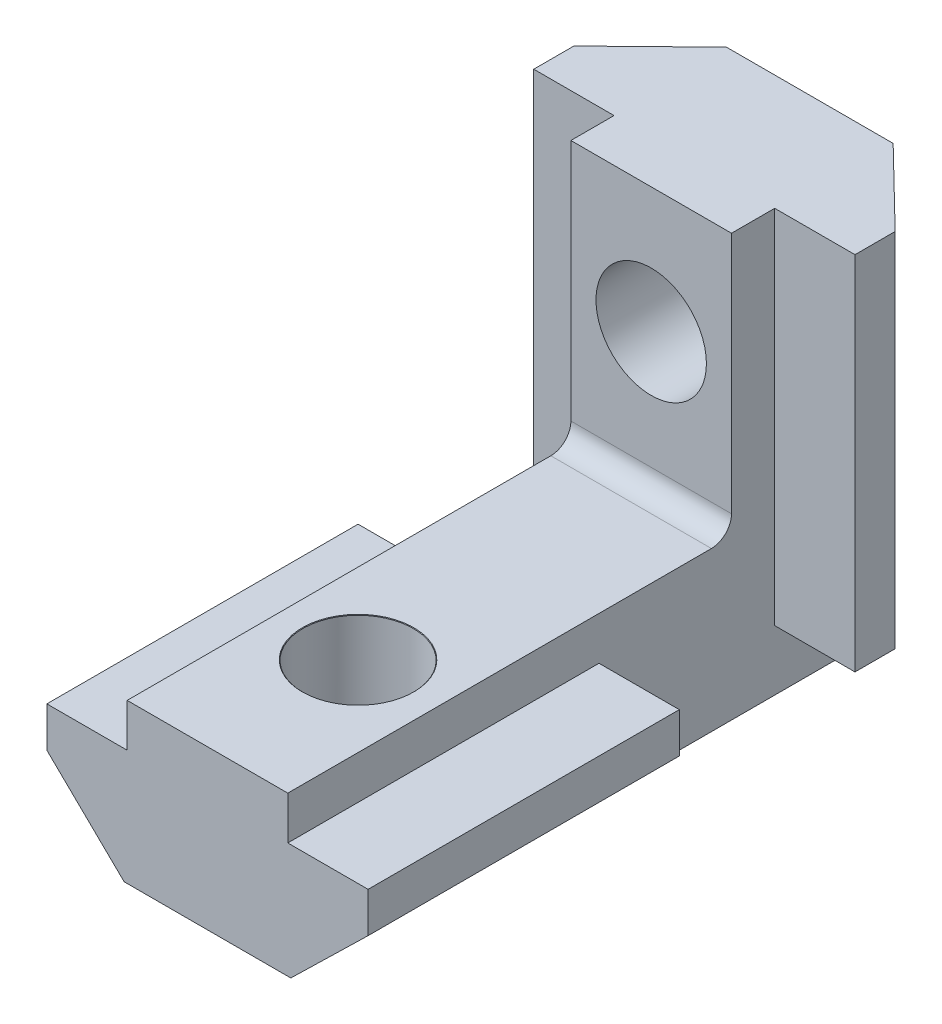
ISO-10303-21;
HEADER;
FILE_DESCRIPTION(('STEP AP214'),'2;1');
FILE_NAME('part.step','',(''),(''),'','','');
FILE_SCHEMA(('AUTOMOTIVE_DESIGN { 1 0 10303 214 1 1 1 1 }'));
ENDSEC;
DATA;
#1=APPLICATION_CONTEXT('core data for automotive mechanical design processes');
#2=APPLICATION_PROTOCOL_DEFINITION('international standard','automotive_design',2000,#1);
#3=PRODUCT_CONTEXT('',#1,'mechanical');
#4=PRODUCT('Part','Part','',(#3));
#5=PRODUCT_RELATED_PRODUCT_CATEGORY('part','',(#4));
#6=PRODUCT_DEFINITION_FORMATION('','',#4);
#7=PRODUCT_DEFINITION_CONTEXT('part definition',#1,'design');
#8=PRODUCT_DEFINITION('design','',#6,#7);
#9=PRODUCT_DEFINITION_SHAPE('','',#8);
#10=(LENGTH_UNIT() NAMED_UNIT(*) SI_UNIT(.MILLI.,.METRE.));
#11=(NAMED_UNIT(*) PLANE_ANGLE_UNIT() SI_UNIT($,.RADIAN.));
#12=(NAMED_UNIT(*) SI_UNIT($,.STERADIAN.) SOLID_ANGLE_UNIT());
#13=UNCERTAINTY_MEASURE_WITH_UNIT(LENGTH_MEASURE(1.E-05),#10,'distance_accuracy_value','');
#14=(GEOMETRIC_REPRESENTATION_CONTEXT(3) GLOBAL_UNCERTAINTY_ASSIGNED_CONTEXT((#13)) GLOBAL_UNIT_ASSIGNED_CONTEXT((#10,
#11,#12)) REPRESENTATION_CONTEXT('',''));
#15=CARTESIAN_POINT('',(0.,0.,0.));
#16=DIRECTION('',(0.,0.,1.));
#17=DIRECTION('',(1.,0.,0.));
#18=AXIS2_PLACEMENT_3D('',#15,#16,#17);
#19=CARTESIAN_POINT('',(-4.,7.9,-15.5));
#20=DIRECTION('',(-1.,0.,0.));
#21=DIRECTION('',(0.,0.,1.));
#22=AXIS2_PLACEMENT_3D('',#19,#20,#21);
#23=PLANE('',#22);
#24=DIRECTION('',(0.,0.,1.));
#25=VECTOR('',#24,1.);
#26=CARTESIAN_POINT('',(-4.,7.9,-15.5));
#27=LINE('',#26,#25);
#28=CARTESIAN_POINT('',(-4.,7.9,-21.1));
#29=VERTEX_POINT('',#28);
#30=CARTESIAN_POINT('',(-4.,7.9,0.));
#31=VERTEX_POINT('',#30);
#32=EDGE_CURVE('E316',#29,#31,#27,.T.);
#33=ORIENTED_EDGE('',*,*,#32,.F.);
#34=CARTESIAN_POINT('',(-4.,8.9,-21.1));
#35=DIRECTION('',(-1.,0.,0.));
#36=DIRECTION('',(0.,0.,1.));
#37=AXIS2_PLACEMENT_3D('',#34,#35,#36);
#38=CIRCLE('',#37,1.);
#39=CARTESIAN_POINT('',(-4.,8.9,-22.1));
#40=VERTEX_POINT('',#39);
#41=EDGE_CURVE('E54',#29,#40,#38,.F.);
#42=ORIENTED_EDGE('',*,*,#41,.T.);
#43=DIRECTION('',(0.,1.,0.));
#44=VECTOR('',#43,1.);
#45=CARTESIAN_POINT('',(-4.,-32.8440466262561,-22.1));
#46=LINE('',#45,#44);
#47=CARTESIAN_POINT('',(-4.,21.,-22.1));
#48=VERTEX_POINT('',#47);
#49=EDGE_CURVE('E258',#40,#48,#46,.T.);
#50=ORIENTED_EDGE('',*,*,#49,.T.);
#51=DIRECTION('',(0.,0.,-1.));
#52=VECTOR('',#51,1.);
#53=CARTESIAN_POINT('',(-4.,21.,-24.25));
#54=LINE('',#53,#52);
#55=CARTESIAN_POINT('',(-4.,21.,-24.25));
#56=VERTEX_POINT('',#55);
#57=EDGE_CURVE('E260',#48,#56,#54,.T.);
#58=ORIENTED_EDGE('',*,*,#57,.T.);
#59=DIRECTION('',(0.,1.,0.));
#60=VECTOR('',#59,1.);
#61=CARTESIAN_POINT('',(-4.,-32.8440466262561,-24.25));
#62=LINE('',#61,#60);
#63=CARTESIAN_POINT('',(-4.,3.,-24.25));
#64=VERTEX_POINT('',#63);
#65=EDGE_CURVE('E261',#64,#56,#62,.T.);
#66=ORIENTED_EDGE('',*,*,#65,.F.);
#67=DIRECTION('',(0.,0.,1.));
#68=VECTOR('',#67,1.);
#69=CARTESIAN_POINT('',(-4.,3.,-15.5));
#70=LINE('',#69,#68);
#71=CARTESIAN_POINT('',(-4.,3.,-30.));
#72=VERTEX_POINT('',#71);
#73=EDGE_CURVE('E229',#72,#64,#70,.T.);
#74=ORIENTED_EDGE('',*,*,#73,.F.);
#75=DIRECTION('',(0.,1.,0.));
#76=VECTOR('',#75,1.);
#77=CARTESIAN_POINT('',(-4.,0.,-30.));
#78=LINE('',#77,#76);
#79=CARTESIAN_POINT('',(-4.,0.,-30.));
#80=VERTEX_POINT('',#79);
#81=EDGE_CURVE('E216',#80,#72,#78,.T.);
#82=ORIENTED_EDGE('',*,*,#81,.F.);
#83=DIRECTION('',(0.,0.,1.));
#84=VECTOR('',#83,1.);
#85=CARTESIAN_POINT('',(-4.,0.,-30.));
#86=LINE('',#85,#84);
#87=CARTESIAN_POINT('',(-4.,0.,-15.5));
#88=VERTEX_POINT('',#87);
#89=EDGE_CURVE('E279',#80,#88,#86,.T.);
#90=ORIENTED_EDGE('',*,*,#89,.T.);
#91=DIRECTION('',(0.,1.,0.));
#92=VECTOR('',#91,1.);
#93=CARTESIAN_POINT('',(-4.,0.,-15.5));
#94=LINE('',#93,#92);
#95=CARTESIAN_POINT('',(-4.,5.75,-15.5));
#96=VERTEX_POINT('',#95);
#97=EDGE_CURVE('E273',#88,#96,#94,.T.);
#98=ORIENTED_EDGE('',*,*,#97,.T.);
#99=DIRECTION('',(0.,0.,1.));
#100=VECTOR('',#99,1.);
#101=CARTESIAN_POINT('',(-4.,5.75,-15.5));
#102=LINE('',#101,#100);
#103=CARTESIAN_POINT('',(-4.,5.75,0.));
#104=VERTEX_POINT('',#103);
#105=EDGE_CURVE('E313',#96,#104,#102,.T.);
#106=ORIENTED_EDGE('',*,*,#105,.T.);
#107=DIRECTION('',(0.,-1.,0.));
#108=VECTOR('',#107,1.);
#109=CARTESIAN_POINT('',(-4.,7.9,0.));
#110=LINE('',#109,#108);
#111=EDGE_CURVE('E339',#31,#104,#110,.T.);
#112=ORIENTED_EDGE('',*,*,#111,.F.);
#113=EDGE_LOOP('',(#33,#42,#50,#58,#66,#74,#82,#90,#98,#106,#112));
#114=FACE_BOUND('',#113,.T.);
#115=ADVANCED_FACE('F46',(#114),#23,.T.);
#116=CARTESIAN_POINT('',(4.,7.9,-15.5));
#117=DIRECTION('',(0.,1.,0.));
#118=DIRECTION('',(0.,0.,1.));
#119=AXIS2_PLACEMENT_3D('',#116,#117,#118);
#120=PLANE('',#119);
#121=CARTESIAN_POINT('',(0.,7.9,-7.5));
#122=DIRECTION('',(0.,1.,0.));
#123=DIRECTION('',(0.,0.,1.));
#124=AXIS2_PLACEMENT_3D('',#121,#122,#123);
#125=CIRCLE('',#124,2.775);
#126=CARTESIAN_POINT('',(0.,7.9,-4.725));
#127=VERTEX_POINT('',#126);
#128=EDGE_CURVE('E502',#127,#127,#125,.T.);
#129=ORIENTED_EDGE('',*,*,#128,.F.);
#130=EDGE_LOOP('',(#129));
#131=FACE_BOUND('',#130,.T.);
#132=DIRECTION('',(0.,0.,1.));
#133=VECTOR('',#132,1.);
#134=CARTESIAN_POINT('',(4.,7.9,-15.5));
#135=LINE('',#134,#133);
#136=CARTESIAN_POINT('',(4.,7.9,-21.1));
#137=VERTEX_POINT('',#136);
#138=CARTESIAN_POINT('',(4.,7.9,0.));
#139=VERTEX_POINT('',#138);
#140=EDGE_CURVE('E302',#137,#139,#135,.T.);
#141=ORIENTED_EDGE('',*,*,#140,.F.);
#142=DIRECTION('',(-1.,0.,0.));
#143=VECTOR('',#142,1.);
#144=CARTESIAN_POINT('',(4.,7.9,-21.1));
#145=LINE('',#144,#143);
#146=EDGE_CURVE('E289',#137,#29,#145,.T.);
#147=ORIENTED_EDGE('',*,*,#146,.T.);
#148=ORIENTED_EDGE('',*,*,#32,.T.);
#149=DIRECTION('',(-1.,0.,0.));
#150=VECTOR('',#149,1.);
#151=CARTESIAN_POINT('',(4.,7.9,0.));
#152=LINE('',#151,#150);
#153=EDGE_CURVE('E383',#139,#31,#152,.T.);
#154=ORIENTED_EDGE('',*,*,#153,.F.);
#155=EDGE_LOOP('',(#141,#147,#148,#154));
#156=FACE_BOUND('',#155,.T.);
#157=ADVANCED_FACE('F333',(#131,#156),#120,.T.);
#158=CARTESIAN_POINT('',(4.,5.75,-15.5));
#159=DIRECTION('',(1.,0.,0.));
#160=DIRECTION('',(0.,0.,-1.));
#161=AXIS2_PLACEMENT_3D('',#158,#159,#160);
#162=PLANE('',#161);
#163=DIRECTION('',(0.,1.,0.));
#164=VECTOR('',#163,1.);
#165=CARTESIAN_POINT('',(4.,-32.8440466262561,-24.25));
#166=LINE('',#165,#164);
#167=CARTESIAN_POINT('',(4.,3.,-24.25));
#168=VERTEX_POINT('',#167);
#169=CARTESIAN_POINT('',(4.,21.,-24.25));
#170=VERTEX_POINT('',#169);
#171=EDGE_CURVE('E252',#168,#170,#166,.T.);
#172=ORIENTED_EDGE('',*,*,#171,.T.);
#173=DIRECTION('',(0.,0.,1.));
#174=VECTOR('',#173,1.);
#175=CARTESIAN_POINT('',(4.,21.,-22.1));
#176=LINE('',#175,#174);
#177=CARTESIAN_POINT('',(4.,21.,-22.1));
#178=VERTEX_POINT('',#177);
#179=EDGE_CURVE('E254',#170,#178,#176,.T.);
#180=ORIENTED_EDGE('',*,*,#179,.T.);
#181=DIRECTION('',(0.,1.,0.));
#182=VECTOR('',#181,1.);
#183=CARTESIAN_POINT('',(4.,-32.8440466262561,-22.1));
#184=LINE('',#183,#182);
#185=CARTESIAN_POINT('',(4.,8.9,-22.1));
#186=VERTEX_POINT('',#185);
#187=EDGE_CURVE('E255',#186,#178,#184,.T.);
#188=ORIENTED_EDGE('',*,*,#187,.F.);
#189=CARTESIAN_POINT('',(4.,8.9,-21.1));
#190=DIRECTION('',(1.,0.,0.));
#191=DIRECTION('',(0.,0.,-1.));
#192=AXIS2_PLACEMENT_3D('',#189,#190,#191);
#193=CIRCLE('',#192,1.);
#194=EDGE_CURVE('E14',#186,#137,#193,.F.);
#195=ORIENTED_EDGE('',*,*,#194,.T.);
#196=ORIENTED_EDGE('',*,*,#140,.T.);
#197=DIRECTION('',(0.,1.,0.));
#198=VECTOR('',#197,1.);
#199=CARTESIAN_POINT('',(4.,5.75,0.));
#200=LINE('',#199,#198);
#201=CARTESIAN_POINT('',(4.,5.75,0.));
#202=VERTEX_POINT('',#201);
#203=EDGE_CURVE('E380',#202,#139,#200,.T.);
#204=ORIENTED_EDGE('',*,*,#203,.F.);
#205=DIRECTION('',(0.,0.,1.));
#206=VECTOR('',#205,1.);
#207=CARTESIAN_POINT('',(4.,5.75,-15.5));
#208=LINE('',#207,#206);
#209=CARTESIAN_POINT('',(4.,5.75,-15.5));
#210=VERTEX_POINT('',#209);
#211=EDGE_CURVE('E300',#210,#202,#208,.T.);
#212=ORIENTED_EDGE('',*,*,#211,.F.);
#213=DIRECTION('',(0.,-1.,0.));
#214=VECTOR('',#213,1.);
#215=CARTESIAN_POINT('',(4.,7.9,-15.5));
#216=LINE('',#215,#214);
#217=CARTESIAN_POINT('',(4.,0.,-15.5));
#218=VERTEX_POINT('',#217);
#219=EDGE_CURVE('E285',#210,#218,#216,.T.);
#220=ORIENTED_EDGE('',*,*,#219,.T.);
#221=DIRECTION('',(0.,0.,1.));
#222=VECTOR('',#221,1.);
#223=CARTESIAN_POINT('',(4.,0.,-30.));
#224=LINE('',#223,#222);
#225=CARTESIAN_POINT('',(4.,0.,-30.));
#226=VERTEX_POINT('',#225);
#227=EDGE_CURVE('E294',#226,#218,#224,.T.);
#228=ORIENTED_EDGE('',*,*,#227,.F.);
#229=DIRECTION('',(0.,-1.,0.));
#230=VECTOR('',#229,1.);
#231=CARTESIAN_POINT('',(4.,7.9,-30.));
#232=LINE('',#231,#230);
#233=CARTESIAN_POINT('',(4.,3.,-30.));
#234=VERTEX_POINT('',#233);
#235=EDGE_CURVE('E274',#234,#226,#232,.T.);
#236=ORIENTED_EDGE('',*,*,#235,.F.);
#237=DIRECTION('',(0.,0.,-1.));
#238=VECTOR('',#237,1.);
#239=CARTESIAN_POINT('',(4.,3.,-15.5));
#240=LINE('',#239,#238);
#241=EDGE_CURVE('E226',#168,#234,#240,.T.);
#242=ORIENTED_EDGE('',*,*,#241,.F.);
#243=EDGE_LOOP('',(#172,#180,#188,#195,#196,#204,#212,#220,#228,#236,#242));
#244=FACE_BOUND('',#243,.T.);
#245=ADVANCED_FACE('F419',(#244),#162,.T.);
#246=CARTESIAN_POINT('',(0.,0.,-15.5));
#247=DIRECTION('',(0.,0.,-1.));
#248=DIRECTION('',(-1.,0.,0.));
#249=AXIS2_PLACEMENT_3D('',#246,#247,#248);
#250=PLANE('',#249);
#251=ORIENTED_EDGE('',*,*,#97,.F.);
#252=DIRECTION('',(1.,0.,0.));
#253=VECTOR('',#252,1.);
#254=CARTESIAN_POINT('',(-4.15,0.,-15.5));
#255=LINE('',#254,#253);
#256=CARTESIAN_POINT('',(-4.15,0.,-15.5));
#257=VERTEX_POINT('',#256);
#258=EDGE_CURVE('E352',#257,#88,#255,.T.);
#259=ORIENTED_EDGE('',*,*,#258,.F.);
#260=DIRECTION('',(0.7163488096607,-0.697742347072111,0.));
#261=VECTOR('',#260,1.);
#262=CARTESIAN_POINT('',(-4.15,0.,-15.5));
#263=LINE('',#262,#261);
#264=CARTESIAN_POINT('',(-8.,3.75,-15.5));
#265=VERTEX_POINT('',#264);
#266=EDGE_CURVE('E358',#265,#257,#263,.T.);
#267=ORIENTED_EDGE('',*,*,#266,.F.);
#268=DIRECTION('',(0.,-1.,0.));
#269=VECTOR('',#268,1.);
#270=CARTESIAN_POINT('',(-8.,3.75,-15.5));
#271=LINE('',#270,#269);
#272=CARTESIAN_POINT('',(-8.,5.75,-15.5));
#273=VERTEX_POINT('',#272);
#274=EDGE_CURVE('E321',#273,#265,#271,.T.);
#275=ORIENTED_EDGE('',*,*,#274,.F.);
#276=DIRECTION('',(-1.,0.,0.));
#277=VECTOR('',#276,1.);
#278=CARTESIAN_POINT('',(-4.,5.75,-15.5));
#279=LINE('',#278,#277);
#280=EDGE_CURVE('E309',#96,#273,#279,.T.);
#281=ORIENTED_EDGE('',*,*,#280,.F.);
#282=EDGE_LOOP('',(#251,#259,#267,#275,#281));
#283=FACE_BOUND('',#282,.T.);
#284=ADVANCED_FACE('F411',(#283),#250,.T.);
#285=CARTESIAN_POINT('',(-4.15,0.,-15.5));
#286=DIRECTION('',(-0.697742347072111,-0.7163488096607,0.));
#287=DIRECTION('',(0.7163488096607,-0.697742347072111,0.));
#288=AXIS2_PLACEMENT_3D('',#285,#286,#287);
#289=PLANE('',#288);
#290=DIRECTION('',(0.7163488096607,-0.697742347072111,0.));
#291=VECTOR('',#290,1.);
#292=CARTESIAN_POINT('',(-4.15,0.,0.));
#293=LINE('',#292,#291);
#294=CARTESIAN_POINT('',(-8.,3.75,0.));
#295=VERTEX_POINT('',#294);
#296=CARTESIAN_POINT('',(-4.15,0.,0.));
#297=VERTEX_POINT('',#296);
#298=EDGE_CURVE('E297',#295,#297,#293,.T.);
#299=ORIENTED_EDGE('',*,*,#298,.F.);
#300=DIRECTION('',(0.,0.,1.));
#301=VECTOR('',#300,1.);
#302=CARTESIAN_POINT('',(-8.,3.75,-15.5));
#303=LINE('',#302,#301);
#304=EDGE_CURVE('E290',#265,#295,#303,.T.);
#305=ORIENTED_EDGE('',*,*,#304,.F.);
#306=ORIENTED_EDGE('',*,*,#266,.T.);
#307=DIRECTION('',(0.,0.,1.));
#308=VECTOR('',#307,1.);
#309=CARTESIAN_POINT('',(-4.15,0.,-15.5));
#310=LINE('',#309,#308);
#311=EDGE_CURVE('E351',#257,#297,#310,.T.);
#312=ORIENTED_EDGE('',*,*,#311,.T.);
#313=EDGE_LOOP('',(#299,#305,#306,#312));
#314=FACE_BOUND('',#313,.T.);
#315=ADVANCED_FACE('F403',(#314),#289,.T.);
#316=CARTESIAN_POINT('',(-8.,3.75,-15.5));
#317=DIRECTION('',(-1.,0.,0.));
#318=DIRECTION('',(0.,0.,1.));
#319=AXIS2_PLACEMENT_3D('',#316,#317,#318);
#320=PLANE('',#319);
#321=DIRECTION('',(0.,-1.,0.));
#322=VECTOR('',#321,1.);
#323=CARTESIAN_POINT('',(-8.,3.75,0.));
#324=LINE('',#323,#322);
#325=CARTESIAN_POINT('',(-8.,5.75,0.));
#326=VERTEX_POINT('',#325);
#327=EDGE_CURVE('E389',#326,#295,#324,.T.);
#328=ORIENTED_EDGE('',*,*,#327,.F.);
#329=DIRECTION('',(0.,0.,1.));
#330=VECTOR('',#329,1.);
#331=CARTESIAN_POINT('',(-8.,5.75,-15.5));
#332=LINE('',#331,#330);
#333=EDGE_CURVE('E315',#273,#326,#332,.T.);
#334=ORIENTED_EDGE('',*,*,#333,.F.);
#335=ORIENTED_EDGE('',*,*,#274,.T.);
#336=ORIENTED_EDGE('',*,*,#304,.T.);
#337=EDGE_LOOP('',(#328,#334,#335,#336));
#338=FACE_BOUND('',#337,.T.);
#339=ADVANCED_FACE('F401',(#338),#320,.T.);
#340=CARTESIAN_POINT('',(-4.,5.75,-15.5));
#341=DIRECTION('',(0.,1.,0.));
#342=DIRECTION('',(0.,0.,1.));
#343=AXIS2_PLACEMENT_3D('',#340,#341,#342);
#344=PLANE('',#343);
#345=DIRECTION('',(-1.,0.,0.));
#346=VECTOR('',#345,1.);
#347=CARTESIAN_POINT('',(-4.,5.75,0.));
#348=LINE('',#347,#346);
#349=EDGE_CURVE('E386',#104,#326,#348,.T.);
#350=ORIENTED_EDGE('',*,*,#349,.F.);
#351=ORIENTED_EDGE('',*,*,#105,.F.);
#352=ORIENTED_EDGE('',*,*,#280,.T.);
#353=ORIENTED_EDGE('',*,*,#333,.T.);
#354=EDGE_LOOP('',(#350,#351,#352,#353));
#355=FACE_BOUND('',#354,.T.);
#356=ADVANCED_FACE('F396',(#355),#344,.T.);
#357=CARTESIAN_POINT('',(8.,5.75,-15.5));
#358=DIRECTION('',(0.,1.,0.));
#359=DIRECTION('',(0.,0.,1.));
#360=AXIS2_PLACEMENT_3D('',#357,#358,#359);
#361=PLANE('',#360);
#362=DIRECTION('',(-1.,0.,0.));
#363=VECTOR('',#362,1.);
#364=CARTESIAN_POINT('',(8.,5.75,0.));
#365=LINE('',#364,#363);
#366=CARTESIAN_POINT('',(8.,5.75,0.));
#367=VERTEX_POINT('',#366);
#368=EDGE_CURVE('E377',#367,#202,#365,.T.);
#369=ORIENTED_EDGE('',*,*,#368,.F.);
#370=DIRECTION('',(0.,0.,1.));
#371=VECTOR('',#370,1.);
#372=CARTESIAN_POINT('',(8.,5.75,-15.5));
#373=LINE('',#372,#371);
#374=CARTESIAN_POINT('',(8.,5.75,-15.5));
#375=VERTEX_POINT('',#374);
#376=EDGE_CURVE('E303',#375,#367,#373,.T.);
#377=ORIENTED_EDGE('',*,*,#376,.F.);
#378=DIRECTION('',(-1.,0.,0.));
#379=VECTOR('',#378,1.);
#380=CARTESIAN_POINT('',(8.,5.75,-15.5));
#381=LINE('',#380,#379);
#382=EDGE_CURVE('E306',#375,#210,#381,.T.);
#383=ORIENTED_EDGE('',*,*,#382,.T.);
#384=ORIENTED_EDGE('',*,*,#211,.T.);
#385=EDGE_LOOP('',(#369,#377,#383,#384));
#386=FACE_BOUND('',#385,.T.);
#387=ADVANCED_FACE('F409',(#386),#361,.T.);
#388=CARTESIAN_POINT('',(8.,3.75,-15.5));
#389=DIRECTION('',(1.,0.,0.));
#390=DIRECTION('',(0.,0.,-1.));
#391=AXIS2_PLACEMENT_3D('',#388,#389,#390);
#392=PLANE('',#391);
#393=DIRECTION('',(0.,1.,0.));
#394=VECTOR('',#393,1.);
#395=CARTESIAN_POINT('',(8.,3.75,0.));
#396=LINE('',#395,#394);
#397=CARTESIAN_POINT('',(8.,3.75,0.));
#398=VERTEX_POINT('',#397);
#399=EDGE_CURVE('E374',#398,#367,#396,.T.);
#400=ORIENTED_EDGE('',*,*,#399,.F.);
#401=DIRECTION('',(0.,0.,1.));
#402=VECTOR('',#401,1.);
#403=CARTESIAN_POINT('',(8.,3.75,-15.5));
#404=LINE('',#403,#402);
#405=CARTESIAN_POINT('',(8.,3.75,-15.5));
#406=VERTEX_POINT('',#405);
#407=EDGE_CURVE('E347',#406,#398,#404,.T.);
#408=ORIENTED_EDGE('',*,*,#407,.F.);
#409=DIRECTION('',(0.,1.,0.));
#410=VECTOR('',#409,1.);
#411=CARTESIAN_POINT('',(8.,3.75,-15.5));
#412=LINE('',#411,#410);
#413=EDGE_CURVE('E310',#406,#375,#412,.T.);
#414=ORIENTED_EDGE('',*,*,#413,.T.);
#415=ORIENTED_EDGE('',*,*,#376,.T.);
#416=EDGE_LOOP('',(#400,#408,#414,#415));
#417=FACE_BOUND('',#416,.T.);
#418=ADVANCED_FACE('F428',(#417),#392,.T.);
#419=CARTESIAN_POINT('',(4.15,0.,-15.5));
#420=DIRECTION('',(0.697742347072111,-0.7163488096607,0.));
#421=DIRECTION('',(0.7163488096607,0.697742347072111,0.));
#422=AXIS2_PLACEMENT_3D('',#419,#420,#421);
#423=PLANE('',#422);
#424=DIRECTION('',(0.7163488096607,0.697742347072111,0.));
#425=VECTOR('',#424,1.);
#426=CARTESIAN_POINT('',(4.15,0.,0.));
#427=LINE('',#426,#425);
#428=CARTESIAN_POINT('',(4.15,0.,0.));
#429=VERTEX_POINT('',#428);
#430=EDGE_CURVE('E371',#429,#398,#427,.T.);
#431=ORIENTED_EDGE('',*,*,#430,.F.);
#432=DIRECTION('',(0.,0.,1.));
#433=VECTOR('',#432,1.);
#434=CARTESIAN_POINT('',(4.15,0.,-15.5));
#435=LINE('',#434,#433);
#436=CARTESIAN_POINT('',(4.15,0.,-15.5));
#437=VERTEX_POINT('',#436);
#438=EDGE_CURVE('E349',#437,#429,#435,.T.);
#439=ORIENTED_EDGE('',*,*,#438,.F.);
#440=DIRECTION('',(0.7163488096607,0.697742347072111,0.));
#441=VECTOR('',#440,1.);
#442=CARTESIAN_POINT('',(4.15,0.,-15.5));
#443=LINE('',#442,#441);
#444=EDGE_CURVE('E354',#437,#406,#443,.T.);
#445=ORIENTED_EDGE('',*,*,#444,.T.);
#446=ORIENTED_EDGE('',*,*,#407,.T.);
#447=EDGE_LOOP('',(#431,#439,#445,#446));
#448=FACE_BOUND('',#447,.T.);
#449=ADVANCED_FACE('F432',(#448),#423,.T.);
#450=CARTESIAN_POINT('',(-4.15,0.,-15.5));
#451=DIRECTION('',(0.,-1.,0.));
#452=DIRECTION('',(0.,0.,-1.));
#453=AXIS2_PLACEMENT_3D('',#450,#451,#452);
#454=PLANE('',#453);
#455=CARTESIAN_POINT('',(0.,0.,-7.5));
#456=DIRECTION('',(0.,-1.,0.));
#457=DIRECTION('',(0.,0.,-1.));
#458=AXIS2_PLACEMENT_3D('',#455,#456,#457);
#459=CIRCLE('',#458,2.75);
#460=CARTESIAN_POINT('',(0.,0.,-10.25));
#461=VERTEX_POINT('',#460);
#462=EDGE_CURVE('E270',#461,#461,#459,.T.);
#463=ORIENTED_EDGE('',*,*,#462,.F.);
#464=EDGE_LOOP('',(#463));
#465=FACE_BOUND('',#464,.T.);
#466=DIRECTION('',(1.,0.,0.));
#467=VECTOR('',#466,1.);
#468=CARTESIAN_POINT('',(-4.15,0.,0.));
#469=LINE('',#468,#467);
#470=EDGE_CURVE('E368',#297,#429,#469,.T.);
#471=ORIENTED_EDGE('',*,*,#470,.F.);
#472=ORIENTED_EDGE('',*,*,#311,.F.);
#473=ORIENTED_EDGE('',*,*,#258,.T.);
#474=ORIENTED_EDGE('',*,*,#89,.F.);
#475=DIRECTION('',(-1.,0.,0.));
#476=VECTOR('',#475,1.);
#477=CARTESIAN_POINT('',(4.,0.,-30.));
#478=LINE('',#477,#476);
#479=EDGE_CURVE('E276',#226,#80,#478,.T.);
#480=ORIENTED_EDGE('',*,*,#479,.F.);
#481=ORIENTED_EDGE('',*,*,#227,.T.);
#482=EDGE_CURVE('E291',#218,#437,#255,.T.);
#483=ORIENTED_EDGE('',*,*,#482,.T.);
#484=ORIENTED_EDGE('',*,*,#438,.T.);
#485=EDGE_LOOP('',(#471,#472,#473,#474,#480,#481,#483,#484));
#486=FACE_BOUND('',#485,.T.);
#487=ADVANCED_FACE('F436',(#465,#486),#454,.T.);
#488=ORIENTED_EDGE('',*,*,#219,.F.);
#489=ORIENTED_EDGE('',*,*,#382,.F.);
#490=ORIENTED_EDGE('',*,*,#413,.F.);
#491=ORIENTED_EDGE('',*,*,#444,.F.);
#492=ORIENTED_EDGE('',*,*,#482,.F.);
#493=EDGE_LOOP('',(#488,#489,#490,#491,#492));
#494=FACE_BOUND('',#493,.T.);
#495=ADVANCED_FACE('F439',(#494),#250,.T.);
#496=CARTESIAN_POINT('',(0.,0.,0.));
#497=DIRECTION('',(0.,0.,-1.));
#498=DIRECTION('',(-1.,0.,0.));
#499=AXIS2_PLACEMENT_3D('',#496,#497,#498);
#500=PLANE('',#499);
#501=ORIENTED_EDGE('',*,*,#298,.T.);
#502=ORIENTED_EDGE('',*,*,#470,.T.);
#503=ORIENTED_EDGE('',*,*,#430,.T.);
#504=ORIENTED_EDGE('',*,*,#399,.T.);
#505=ORIENTED_EDGE('',*,*,#368,.T.);
#506=ORIENTED_EDGE('',*,*,#203,.T.);
#507=ORIENTED_EDGE('',*,*,#153,.T.);
#508=ORIENTED_EDGE('',*,*,#111,.T.);
#509=ORIENTED_EDGE('',*,*,#349,.T.);
#510=ORIENTED_EDGE('',*,*,#327,.T.);
#511=EDGE_LOOP('',(#501,#502,#503,#504,#505,#506,#507,#508,#509,#510));
#512=FACE_BOUND('',#511,.T.);
#513=ADVANCED_FACE('F400',(#512),#500,.F.);
#514=CARTESIAN_POINT('',(0.,0.,-30.));
#515=DIRECTION('',(0.,0.,-1.));
#516=DIRECTION('',(-1.,0.,0.));
#517=AXIS2_PLACEMENT_3D('',#514,#515,#516);
#518=PLANE('',#517);
#519=CARTESIAN_POINT('',(0.,14.75,-30.));
#520=DIRECTION('',(0.,0.,-1.));
#521=DIRECTION('',(-1.,0.,0.));
#522=AXIS2_PLACEMENT_3D('',#519,#520,#521);
#523=CIRCLE('',#522,2.75);
#524=CARTESIAN_POINT('',(-2.75,14.75,-30.));
#525=VERTEX_POINT('',#524);
#526=EDGE_CURVE('E500',#525,#525,#523,.T.);
#527=ORIENTED_EDGE('',*,*,#526,.F.);
#528=EDGE_LOOP('',(#527));
#529=FACE_BOUND('',#528,.T.);
#530=ORIENTED_EDGE('',*,*,#81,.T.);
#531=DIRECTION('',(1.,0.,0.));
#532=VECTOR('',#531,1.);
#533=CARTESIAN_POINT('',(4.15,3.,-30.));
#534=LINE('',#533,#532);
#535=CARTESIAN_POINT('',(-4.15,3.,-30.));
#536=VERTEX_POINT('',#535);
#537=EDGE_CURVE('E213',#536,#72,#534,.T.);
#538=ORIENTED_EDGE('',*,*,#537,.F.);
#539=DIRECTION('',(0.,1.,0.));
#540=VECTOR('',#539,1.);
#541=CARTESIAN_POINT('',(-4.15,-32.8440466262561,-30.));
#542=LINE('',#541,#540);
#543=CARTESIAN_POINT('',(-4.15,21.,-30.));
#544=VERTEX_POINT('',#543);
#545=EDGE_CURVE('E198',#536,#544,#542,.T.);
#546=ORIENTED_EDGE('',*,*,#545,.T.);
#547=DIRECTION('',(1.,0.,0.));
#548=VECTOR('',#547,1.);
#549=CARTESIAN_POINT('',(4.15,21.,-30.));
#550=LINE('',#549,#548);
#551=CARTESIAN_POINT('',(4.15,21.,-30.));
#552=VERTEX_POINT('',#551);
#553=EDGE_CURVE('E209',#544,#552,#550,.T.);
#554=ORIENTED_EDGE('',*,*,#553,.T.);
#555=DIRECTION('',(0.,1.,0.));
#556=VECTOR('',#555,1.);
#557=CARTESIAN_POINT('',(4.15,-32.8440466262561,-30.));
#558=LINE('',#557,#556);
#559=CARTESIAN_POINT('',(4.15,3.,-30.));
#560=VERTEX_POINT('',#559);
#561=EDGE_CURVE('E269',#560,#552,#558,.T.);
#562=ORIENTED_EDGE('',*,*,#561,.F.);
#563=EDGE_CURVE('E220',#234,#560,#534,.T.);
#564=ORIENTED_EDGE('',*,*,#563,.F.);
#565=ORIENTED_EDGE('',*,*,#235,.T.);
#566=ORIENTED_EDGE('',*,*,#479,.T.);
#567=EDGE_LOOP('',(#530,#538,#546,#554,#562,#564,#565,#566));
#568=FACE_BOUND('',#567,.T.);
#569=ADVANCED_FACE('F214',(#529,#568),#518,.T.);
#570=CARTESIAN_POINT('',(0.,3.,0.));
#571=DIRECTION('',(0.,-1.,0.));
#572=DIRECTION('',(0.,0.,-1.));
#573=AXIS2_PLACEMENT_3D('',#570,#571,#572);
#574=PLANE('',#573);
#575=ORIENTED_EDGE('',*,*,#537,.T.);
#576=ORIENTED_EDGE('',*,*,#73,.T.);
#577=DIRECTION('',(-1.,0.,0.));
#578=VECTOR('',#577,1.);
#579=CARTESIAN_POINT('',(-8.,3.,-24.25));
#580=LINE('',#579,#578);
#581=CARTESIAN_POINT('',(-8.,3.,-24.25));
#582=VERTEX_POINT('',#581);
#583=EDGE_CURVE('E231',#64,#582,#580,.T.);
#584=ORIENTED_EDGE('',*,*,#583,.T.);
#585=DIRECTION('',(0.,0.,-1.));
#586=VECTOR('',#585,1.);
#587=CARTESIAN_POINT('',(-8.,3.,-24.25));
#588=LINE('',#587,#586);
#589=CARTESIAN_POINT('',(-8.,3.,-26.25));
#590=VERTEX_POINT('',#589);
#591=EDGE_CURVE('E225',#582,#590,#588,.T.);
#592=ORIENTED_EDGE('',*,*,#591,.T.);
#593=DIRECTION('',(0.7163488096607,0.,-0.697742347072111));
#594=VECTOR('',#593,1.);
#595=CARTESIAN_POINT('',(-4.15,3.,-30.));
#596=LINE('',#595,#594);
#597=EDGE_CURVE('E202',#590,#536,#596,.T.);
#598=ORIENTED_EDGE('',*,*,#597,.T.);
#599=EDGE_LOOP('',(#575,#576,#584,#592,#598));
#600=FACE_BOUND('',#599,.T.);
#601=ADVANCED_FACE('F223',(#600),#574,.T.);
#602=CARTESIAN_POINT('',(4.15,-32.8440466262561,-30.));
#603=DIRECTION('',(-0.697742347072111,0.,0.7163488096607));
#604=DIRECTION('',(0.7163488096607,0.,0.697742347072111));
#605=AXIS2_PLACEMENT_3D('',#602,#603,#604);
#606=PLANE('',#605);
#607=DIRECTION('',(0.7163488096607,0.,0.697742347072111));
#608=VECTOR('',#607,1.);
#609=CARTESIAN_POINT('',(4.15,3.,-30.));
#610=LINE('',#609,#608);
#611=CARTESIAN_POINT('',(8.,3.,-26.25));
#612=VERTEX_POINT('',#611);
#613=EDGE_CURVE('E219',#560,#612,#610,.T.);
#614=ORIENTED_EDGE('',*,*,#613,.F.);
#615=ORIENTED_EDGE('',*,*,#561,.T.);
#616=DIRECTION('',(0.7163488096607,0.,0.697742347072111));
#617=VECTOR('',#616,1.);
#618=CARTESIAN_POINT('',(4.15,21.,-30.));
#619=LINE('',#618,#617);
#620=CARTESIAN_POINT('',(8.,21.,-26.25));
#621=VERTEX_POINT('',#620);
#622=EDGE_CURVE('E234',#552,#621,#619,.T.);
#623=ORIENTED_EDGE('',*,*,#622,.T.);
#624=DIRECTION('',(0.,1.,0.));
#625=VECTOR('',#624,1.);
#626=CARTESIAN_POINT('',(8.,-32.8440466262561,-26.25));
#627=LINE('',#626,#625);
#628=EDGE_CURVE('E246',#612,#621,#627,.T.);
#629=ORIENTED_EDGE('',*,*,#628,.F.);
#630=EDGE_LOOP('',(#614,#615,#623,#629));
#631=FACE_BOUND('',#630,.T.);
#632=ADVANCED_FACE('F487',(#631),#606,.F.);
#633=CARTESIAN_POINT('',(8.,-32.8440466262561,-24.25));
#634=DIRECTION('',(-1.,0.,0.));
#635=DIRECTION('',(0.,0.,1.));
#636=AXIS2_PLACEMENT_3D('',#633,#634,#635);
#637=PLANE('',#636);
#638=DIRECTION('',(0.,0.,1.));
#639=VECTOR('',#638,1.);
#640=CARTESIAN_POINT('',(8.,3.,-24.25));
#641=LINE('',#640,#639);
#642=CARTESIAN_POINT('',(8.,3.,-24.25));
#643=VERTEX_POINT('',#642);
#644=EDGE_CURVE('E241',#612,#643,#641,.T.);
#645=ORIENTED_EDGE('',*,*,#644,.F.);
#646=ORIENTED_EDGE('',*,*,#628,.T.);
#647=DIRECTION('',(0.,0.,1.));
#648=VECTOR('',#647,1.);
#649=CARTESIAN_POINT('',(8.,21.,-24.25));
#650=LINE('',#649,#648);
#651=CARTESIAN_POINT('',(8.,21.,-24.25));
#652=VERTEX_POINT('',#651);
#653=EDGE_CURVE('E248',#621,#652,#650,.T.);
#654=ORIENTED_EDGE('',*,*,#653,.T.);
#655=DIRECTION('',(0.,1.,0.));
#656=VECTOR('',#655,1.);
#657=CARTESIAN_POINT('',(8.,-32.8440466262561,-24.25));
#658=LINE('',#657,#656);
#659=EDGE_CURVE('E249',#643,#652,#658,.T.);
#660=ORIENTED_EDGE('',*,*,#659,.F.);
#661=EDGE_LOOP('',(#645,#646,#654,#660));
#662=FACE_BOUND('',#661,.T.);
#663=ADVANCED_FACE('F492',(#662),#637,.F.);
#664=CARTESIAN_POINT('',(4.,-32.8440466262561,-24.25));
#665=DIRECTION('',(0.,0.,-1.));
#666=DIRECTION('',(-1.,0.,0.));
#667=AXIS2_PLACEMENT_3D('',#664,#665,#666);
#668=PLANE('',#667);
#669=DIRECTION('',(-1.,0.,0.));
#670=VECTOR('',#669,1.);
#671=CARTESIAN_POINT('',(4.,3.,-24.25));
#672=LINE('',#671,#670);
#673=EDGE_CURVE('E238',#643,#168,#672,.T.);
#674=ORIENTED_EDGE('',*,*,#673,.F.);
#675=ORIENTED_EDGE('',*,*,#659,.T.);
#676=DIRECTION('',(-1.,0.,0.));
#677=VECTOR('',#676,1.);
#678=CARTESIAN_POINT('',(4.,21.,-24.25));
#679=LINE('',#678,#677);
#680=EDGE_CURVE('E251',#652,#170,#679,.T.);
#681=ORIENTED_EDGE('',*,*,#680,.T.);
#682=ORIENTED_EDGE('',*,*,#171,.F.);
#683=EDGE_LOOP('',(#674,#675,#681,#682));
#684=FACE_BOUND('',#683,.T.);
#685=ADVANCED_FACE('F538',(#684),#668,.F.);
#686=CARTESIAN_POINT('',(-4.,-32.8440466262561,-22.1));
#687=DIRECTION('',(0.,0.,-1.));
#688=DIRECTION('',(-1.,0.,0.));
#689=AXIS2_PLACEMENT_3D('',#686,#687,#688);
#690=PLANE('',#689);
#691=CARTESIAN_POINT('',(0.,14.75,-22.1));
#692=DIRECTION('',(0.,0.,1.));
#693=DIRECTION('',(1.,0.,0.));
#694=AXIS2_PLACEMENT_3D('',#691,#692,#693);
#695=CIRCLE('',#694,2.75);
#696=CARTESIAN_POINT('',(2.75,14.75,-22.1));
#697=VERTEX_POINT('',#696);
#698=EDGE_CURVE('E503',#697,#697,#695,.T.);
#699=ORIENTED_EDGE('',*,*,#698,.F.);
#700=EDGE_LOOP('',(#699));
#701=FACE_BOUND('',#700,.T.);
#702=ORIENTED_EDGE('',*,*,#49,.F.);
#703=DIRECTION('',(-1.,0.,0.));
#704=VECTOR('',#703,1.);
#705=CARTESIAN_POINT('',(-4.,8.9,-22.1));
#706=LINE('',#705,#704);
#707=EDGE_CURVE('E67',#40,#186,#706,.F.);
#708=ORIENTED_EDGE('',*,*,#707,.T.);
#709=ORIENTED_EDGE('',*,*,#187,.T.);
#710=DIRECTION('',(-1.,0.,0.));
#711=VECTOR('',#710,1.);
#712=CARTESIAN_POINT('',(-4.,21.,-22.1));
#713=LINE('',#712,#711);
#714=EDGE_CURVE('E257',#178,#48,#713,.T.);
#715=ORIENTED_EDGE('',*,*,#714,.T.);
#716=EDGE_LOOP('',(#702,#708,#709,#715));
#717=FACE_BOUND('',#716,.T.);
#718=ADVANCED_FACE('F553',(#701,#717),#690,.F.);
#719=CARTESIAN_POINT('',(-8.,-32.8440466262561,-24.25));
#720=DIRECTION('',(0.,0.,-1.));
#721=DIRECTION('',(-1.,0.,0.));
#722=AXIS2_PLACEMENT_3D('',#719,#720,#721);
#723=PLANE('',#722);
#724=ORIENTED_EDGE('',*,*,#583,.F.);
#725=ORIENTED_EDGE('',*,*,#65,.T.);
#726=DIRECTION('',(-1.,0.,0.));
#727=VECTOR('',#726,1.);
#728=CARTESIAN_POINT('',(-8.,21.,-24.25));
#729=LINE('',#728,#727);
#730=CARTESIAN_POINT('',(-8.,21.,-24.25));
#731=VERTEX_POINT('',#730);
#732=EDGE_CURVE('E263',#56,#731,#729,.T.);
#733=ORIENTED_EDGE('',*,*,#732,.T.);
#734=DIRECTION('',(0.,1.,0.));
#735=VECTOR('',#734,1.);
#736=CARTESIAN_POINT('',(-8.,-32.8440466262561,-24.25));
#737=LINE('',#736,#735);
#738=EDGE_CURVE('E264',#582,#731,#737,.T.);
#739=ORIENTED_EDGE('',*,*,#738,.F.);
#740=EDGE_LOOP('',(#724,#725,#733,#739));
#741=FACE_BOUND('',#740,.T.);
#742=ADVANCED_FACE('F548',(#741),#723,.F.);
#743=CARTESIAN_POINT('',(-8.,-32.8440466262561,-24.25));
#744=DIRECTION('',(1.,0.,0.));
#745=DIRECTION('',(0.,0.,-1.));
#746=AXIS2_PLACEMENT_3D('',#743,#744,#745);
#747=PLANE('',#746);
#748=ORIENTED_EDGE('',*,*,#591,.F.);
#749=ORIENTED_EDGE('',*,*,#738,.T.);
#750=DIRECTION('',(0.,0.,-1.));
#751=VECTOR('',#750,1.);
#752=CARTESIAN_POINT('',(-8.,21.,-24.25));
#753=LINE('',#752,#751);
#754=CARTESIAN_POINT('',(-8.,21.,-26.25));
#755=VERTEX_POINT('',#754);
#756=EDGE_CURVE('E266',#731,#755,#753,.T.);
#757=ORIENTED_EDGE('',*,*,#756,.T.);
#758=DIRECTION('',(0.,1.,0.));
#759=VECTOR('',#758,1.);
#760=CARTESIAN_POINT('',(-8.,-32.8440466262561,-26.25));
#761=LINE('',#760,#759);
#762=EDGE_CURVE('E267',#590,#755,#761,.T.);
#763=ORIENTED_EDGE('',*,*,#762,.F.);
#764=EDGE_LOOP('',(#748,#749,#757,#763));
#765=FACE_BOUND('',#764,.T.);
#766=ADVANCED_FACE('F551',(#765),#747,.F.);
#767=CARTESIAN_POINT('',(-4.15,-32.8440466262561,-30.));
#768=DIRECTION('',(0.697742347072111,0.,0.7163488096607));
#769=DIRECTION('',(0.7163488096607,0.,-0.697742347072111));
#770=AXIS2_PLACEMENT_3D('',#767,#768,#769);
#771=PLANE('',#770);
#772=ORIENTED_EDGE('',*,*,#597,.F.);
#773=ORIENTED_EDGE('',*,*,#762,.T.);
#774=DIRECTION('',(0.7163488096607,0.,-0.697742347072111));
#775=VECTOR('',#774,1.);
#776=CARTESIAN_POINT('',(-4.15,21.,-30.));
#777=LINE('',#776,#775);
#778=EDGE_CURVE('E205',#755,#544,#777,.T.);
#779=ORIENTED_EDGE('',*,*,#778,.T.);
#780=ORIENTED_EDGE('',*,*,#545,.F.);
#781=EDGE_LOOP('',(#772,#773,#779,#780));
#782=FACE_BOUND('',#781,.T.);
#783=ADVANCED_FACE('F200',(#782),#771,.F.);
#784=CARTESIAN_POINT('',(0.,21.,0.));
#785=DIRECTION('',(0.,-1.,0.));
#786=DIRECTION('',(0.,0.,-1.));
#787=AXIS2_PLACEMENT_3D('',#784,#785,#786);
#788=PLANE('',#787);
#789=ORIENTED_EDGE('',*,*,#622,.F.);
#790=ORIENTED_EDGE('',*,*,#553,.F.);
#791=ORIENTED_EDGE('',*,*,#778,.F.);
#792=ORIENTED_EDGE('',*,*,#756,.F.);
#793=ORIENTED_EDGE('',*,*,#732,.F.);
#794=ORIENTED_EDGE('',*,*,#57,.F.);
#795=ORIENTED_EDGE('',*,*,#714,.F.);
#796=ORIENTED_EDGE('',*,*,#179,.F.);
#797=ORIENTED_EDGE('',*,*,#680,.F.);
#798=ORIENTED_EDGE('',*,*,#653,.F.);
#799=EDGE_LOOP('',(#789,#790,#791,#792,#793,#794,#795,#796,#797,#798));
#800=FACE_BOUND('',#799,.T.);
#801=ADVANCED_FACE('F476',(#800),#788,.F.);
#802=ORIENTED_EDGE('',*,*,#673,.T.);
#803=ORIENTED_EDGE('',*,*,#241,.T.);
#804=ORIENTED_EDGE('',*,*,#563,.T.);
#805=ORIENTED_EDGE('',*,*,#613,.T.);
#806=ORIENTED_EDGE('',*,*,#644,.T.);
#807=EDGE_LOOP('',(#802,#803,#804,#805,#806));
#808=FACE_BOUND('',#807,.T.);
#809=ADVANCED_FACE('F468',(#808),#574,.T.);
#810=CARTESIAN_POINT('',(4.,8.9,-21.1));
#811=DIRECTION('',(-1.,0.,0.));
#812=DIRECTION('',(0.,0.,1.));
#813=AXIS2_PLACEMENT_3D('',#810,#811,#812);
#814=CYLINDRICAL_SURFACE('',#813,1.);
#815=ORIENTED_EDGE('',*,*,#194,.F.);
#816=ORIENTED_EDGE('',*,*,#707,.F.);
#817=ORIENTED_EDGE('',*,*,#41,.F.);
#818=ORIENTED_EDGE('',*,*,#146,.F.);
#819=EDGE_LOOP('',(#815,#816,#817,#818));
#820=FACE_BOUND('',#819,.T.);
#821=ADVANCED_FACE('F48',(#820),#814,.F.);
#822=CARTESIAN_POINT('',(0.,7.9,-7.5));
#823=DIRECTION('',(0.,1.,0.));
#824=DIRECTION('',(0.,0.,1.));
#825=AXIS2_PLACEMENT_3D('',#822,#823,#824);
#826=CYLINDRICAL_SURFACE('',#825,2.75);
#827=CARTESIAN_POINT('',(0.,7.875,-7.5));
#828=DIRECTION('',(0.,1.,0.));
#829=DIRECTION('',(0.,0.,1.));
#830=AXIS2_PLACEMENT_3D('',#827,#828,#829);
#831=CIRCLE('',#830,2.75);
#832=CARTESIAN_POINT('',(0.,7.875,-4.75));
#833=VERTEX_POINT('',#832);
#834=EDGE_CURVE('E506',#833,#833,#831,.T.);
#835=ORIENTED_EDGE('',*,*,#834,.T.);
#836=EDGE_LOOP('',(#835));
#837=FACE_BOUND('',#836,.T.);
#838=ORIENTED_EDGE('',*,*,#462,.T.);
#839=EDGE_LOOP('',(#838));
#840=FACE_BOUND('',#839,.T.);
#841=ADVANCED_FACE('F467',(#837,#840),#826,.F.);
#842=CARTESIAN_POINT('',(0.,7.9,-7.5));
#843=DIRECTION('',(0.,1.,0.));
#844=DIRECTION('',(0.,0.,1.));
#845=AXIS2_PLACEMENT_3D('',#842,#843,#844);
#846=CONICAL_SURFACE('',#845,2.775,0.785398163397448);
#847=ORIENTED_EDGE('',*,*,#834,.F.);
#848=EDGE_LOOP('',(#847));
#849=FACE_BOUND('',#848,.T.);
#850=ORIENTED_EDGE('',*,*,#128,.T.);
#851=EDGE_LOOP('',(#850));
#852=FACE_BOUND('',#851,.T.);
#853=ADVANCED_FACE('F473',(#849,#852),#846,.F.);
#854=CARTESIAN_POINT('',(0.,14.75,-22.1));
#855=DIRECTION('',(0.,0.,1.));
#856=DIRECTION('',(1.,0.,0.));
#857=AXIS2_PLACEMENT_3D('',#854,#855,#856);
#858=CYLINDRICAL_SURFACE('',#857,2.75);
#859=ORIENTED_EDGE('',*,*,#526,.T.);
#860=EDGE_LOOP('',(#859));
#861=FACE_BOUND('',#860,.T.);
#862=ORIENTED_EDGE('',*,*,#698,.T.);
#863=EDGE_LOOP('',(#862));
#864=FACE_BOUND('',#863,.T.);
#865=ADVANCED_FACE('F654',(#861,#864),#858,.F.);
#866=CLOSED_SHELL('',(#115,#157,#245,#284,#315,#339,#356,#387,#418,#449,#487,#495,#513,#569,
#601,#632,#663,#685,#718,#742,#766,#783,#801,#809,#821,#841,#853,#865));
#867=MANIFOLD_SOLID_BREP('B2',#866);
#868=ADVANCED_BREP_SHAPE_REPRESENTATION('',(#18,#867),#14);
#869=SHAPE_DEFINITION_REPRESENTATION(#9,#868);
ENDSEC;
END-ISO-10303-21;
